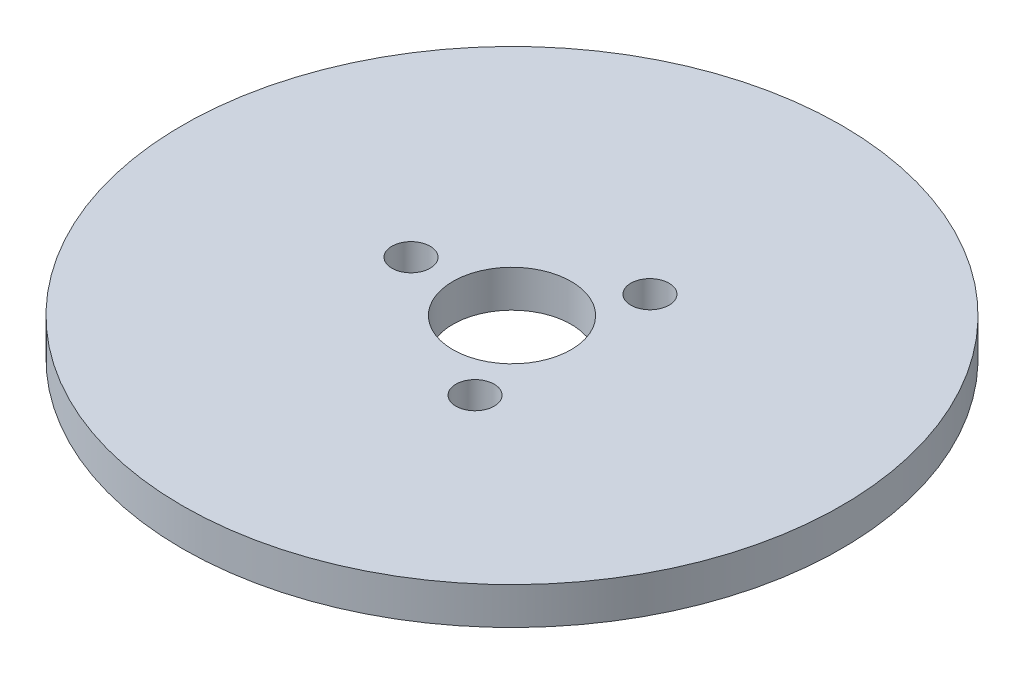
ISO-10303-21;
HEADER;
FILE_DESCRIPTION(('STEP AP214'),'2;1');
FILE_NAME('part.step','',(''),(''),'','','');
FILE_SCHEMA(('AUTOMOTIVE_DESIGN { 1 0 10303 214 1 1 1 1 }'));
ENDSEC;
DATA;
#1=APPLICATION_CONTEXT('core data for automotive mechanical design processes');
#2=APPLICATION_PROTOCOL_DEFINITION('international standard','automotive_design',2000,#1);
#3=PRODUCT_CONTEXT('',#1,'mechanical');
#4=PRODUCT('Part','Part','',(#3));
#5=PRODUCT_RELATED_PRODUCT_CATEGORY('part','',(#4));
#6=PRODUCT_DEFINITION_FORMATION('','',#4);
#7=PRODUCT_DEFINITION_CONTEXT('part definition',#1,'design');
#8=PRODUCT_DEFINITION('design','',#6,#7);
#9=PRODUCT_DEFINITION_SHAPE('','',#8);
#10=(LENGTH_UNIT() NAMED_UNIT(*) SI_UNIT(.MILLI.,.METRE.));
#11=(NAMED_UNIT(*) PLANE_ANGLE_UNIT() SI_UNIT($,.RADIAN.));
#12=(NAMED_UNIT(*) SI_UNIT($,.STERADIAN.) SOLID_ANGLE_UNIT());
#13=UNCERTAINTY_MEASURE_WITH_UNIT(LENGTH_MEASURE(1.E-05),#10,'distance_accuracy_value','');
#14=(GEOMETRIC_REPRESENTATION_CONTEXT(3) GLOBAL_UNCERTAINTY_ASSIGNED_CONTEXT((#13)) GLOBAL_UNIT_ASSIGNED_CONTEXT((#10,
#11,#12)) REPRESENTATION_CONTEXT('',''));
#15=CARTESIAN_POINT('',(0.,0.,0.));
#16=DIRECTION('',(0.,0.,1.));
#17=DIRECTION('',(1.,0.,0.));
#18=AXIS2_PLACEMENT_3D('',#15,#16,#17);
#19=CARTESIAN_POINT('',(0.,11.,0.));
#20=DIRECTION('',(0.,-1.,0.));
#21=DIRECTION('',(0.,0.,-1.));
#22=AXIS2_PLACEMENT_3D('',#19,#20,#21);
#23=CYLINDRICAL_SURFACE('',#22,97.5);
#24=CARTESIAN_POINT('',(0.,11.,0.));
#25=DIRECTION('',(0.,1.,0.));
#26=DIRECTION('',(0.,0.,1.));
#27=AXIS2_PLACEMENT_3D('',#24,#25,#26);
#28=CIRCLE('',#27,97.5);
#29=CARTESIAN_POINT('',(0.,11.,97.5));
#30=VERTEX_POINT('',#29);
#31=EDGE_CURVE('E10',#30,#30,#28,.T.);
#32=ORIENTED_EDGE('',*,*,#31,.F.);
#33=EDGE_LOOP('',(#32));
#34=FACE_BOUND('',#33,.T.);
#35=CARTESIAN_POINT('',(0.,0.,0.));
#36=DIRECTION('',(0.,1.,0.));
#37=DIRECTION('',(0.,0.,1.));
#38=AXIS2_PLACEMENT_3D('',#35,#36,#37);
#39=CIRCLE('',#38,97.5);
#40=CARTESIAN_POINT('',(0.,0.,97.5));
#41=VERTEX_POINT('',#40);
#42=EDGE_CURVE('E37',#41,#41,#39,.T.);
#43=ORIENTED_EDGE('',*,*,#42,.T.);
#44=EDGE_LOOP('',(#43));
#45=FACE_BOUND('',#44,.T.);
#46=ADVANCED_FACE('F40',(#34,#45),#23,.T.);
#47=CARTESIAN_POINT('',(0.,11.,0.));
#48=DIRECTION('',(0.,1.,0.));
#49=DIRECTION('',(0.,0.,1.));
#50=AXIS2_PLACEMENT_3D('',#47,#48,#49);
#51=PLANE('',#50);
#52=CARTESIAN_POINT('',(14.9383163242775,11.,25.8739228531838));
#53=DIRECTION('',(0.,1.,0.));
#54=DIRECTION('',(0.866025403784436,0.,-0.500000000000004));
#55=AXIS2_PLACEMENT_3D('',#52,#53,#54);
#56=CIRCLE('',#55,5.65584481475102);
#57=CARTESIAN_POINT('',(19.8364216137143,11.,23.0460004458083));
#58=VERTEX_POINT('',#57);
#59=EDGE_CURVE('E70',#58,#58,#56,.T.);
#60=ORIENTED_EDGE('',*,*,#59,.F.);
#61=EDGE_LOOP('',(#60));
#62=FACE_BOUND('',#61,.T.);
#63=CARTESIAN_POINT('',(14.9383163242771,11.,-25.873922853184));
#64=DIRECTION('',(0.,1.,0.));
#65=DIRECTION('',(-0.866025403784443,0.,-0.499999999999992));
#66=AXIS2_PLACEMENT_3D('',#63,#64,#65);
#67=CIRCLE('',#66,5.65584481475102);
#68=CARTESIAN_POINT('',(10.0402110348402,11.,-28.7018452605595));
#69=VERTEX_POINT('',#68);
#70=EDGE_CURVE('E61',#69,#69,#67,.T.);
#71=ORIENTED_EDGE('',*,*,#70,.F.);
#72=EDGE_LOOP('',(#71));
#73=FACE_BOUND('',#72,.T.);
#74=CARTESIAN_POINT('',(-29.8766326485547,11.,0.));
#75=DIRECTION('',(0.,1.,0.));
#76=DIRECTION('',(0.,0.,1.));
#77=AXIS2_PLACEMENT_3D('',#74,#75,#76);
#78=CIRCLE('',#77,5.65584481475102);
#79=CARTESIAN_POINT('',(-29.8766326485547,11.,5.65584481475102));
#80=VERTEX_POINT('',#79);
#81=EDGE_CURVE('E54',#80,#80,#78,.T.);
#82=ORIENTED_EDGE('',*,*,#81,.F.);
#83=EDGE_LOOP('',(#82));
#84=FACE_BOUND('',#83,.T.);
#85=CARTESIAN_POINT('',(0.,11.,0.));
#86=DIRECTION('',(0.,1.,0.));
#87=DIRECTION('',(0.,0.,1.));
#88=AXIS2_PLACEMENT_3D('',#85,#86,#87);
#89=CIRCLE('',#88,17.5);
#90=CARTESIAN_POINT('',(0.,11.,17.5));
#91=VERTEX_POINT('',#90);
#92=EDGE_CURVE('E50',#91,#91,#89,.T.);
#93=ORIENTED_EDGE('',*,*,#92,.F.);
#94=EDGE_LOOP('',(#93));
#95=FACE_BOUND('',#94,.T.);
#96=ORIENTED_EDGE('',*,*,#31,.T.);
#97=EDGE_LOOP('',(#96));
#98=FACE_BOUND('',#97,.T.);
#99=ADVANCED_FACE('F85',(#62,#73,#84,#95,#98),#51,.T.);
#100=CARTESIAN_POINT('',(0.,0.,0.));
#101=DIRECTION('',(0.,1.,0.));
#102=DIRECTION('',(0.,0.,1.));
#103=AXIS2_PLACEMENT_3D('',#100,#101,#102);
#104=PLANE('',#103);
#105=CARTESIAN_POINT('',(0.,0.,0.));
#106=DIRECTION('',(0.,1.,0.));
#107=DIRECTION('',(0.,0.,1.));
#108=AXIS2_PLACEMENT_3D('',#105,#106,#107);
#109=CIRCLE('',#108,17.5);
#110=CARTESIAN_POINT('',(0.,0.,17.5));
#111=VERTEX_POINT('',#110);
#112=EDGE_CURVE('E47',#111,#111,#109,.T.);
#113=ORIENTED_EDGE('',*,*,#112,.T.);
#114=EDGE_LOOP('',(#113));
#115=FACE_BOUND('',#114,.T.);
#116=ORIENTED_EDGE('',*,*,#42,.F.);
#117=EDGE_LOOP('',(#116));
#118=FACE_BOUND('',#117,.T.);
#119=ADVANCED_FACE('F84',(#115,#118),#104,.F.);
#120=CARTESIAN_POINT('',(0.,11.,0.));
#121=DIRECTION('',(0.,-1.,0.));
#122=DIRECTION('',(0.,0.,-1.));
#123=AXIS2_PLACEMENT_3D('',#120,#121,#122);
#124=CYLINDRICAL_SURFACE('',#123,17.5);
#125=ORIENTED_EDGE('',*,*,#92,.T.);
#126=EDGE_LOOP('',(#125));
#127=FACE_BOUND('',#126,.T.);
#128=ORIENTED_EDGE('',*,*,#112,.F.);
#129=EDGE_LOOP('',(#128));
#130=FACE_BOUND('',#129,.T.);
#131=ADVANCED_FACE('F91',(#127,#130),#124,.F.);
#132=CARTESIAN_POINT('',(-29.8766326485547,0.834107284151632,0.));
#133=DIRECTION('',(0.,1.,0.));
#134=DIRECTION('',(0.,0.,1.));
#135=AXIS2_PLACEMENT_3D('',#132,#133,#134);
#136=CYLINDRICAL_SURFACE('',#135,5.65584481475102);
#137=CARTESIAN_POINT('',(-29.8766326485547,0.834107284151632,0.));
#138=DIRECTION('',(0.,1.,0.));
#139=DIRECTION('',(0.,0.,1.));
#140=AXIS2_PLACEMENT_3D('',#137,#138,#139);
#141=CIRCLE('',#140,5.65584481475102);
#142=CARTESIAN_POINT('',(-29.8766326485547,0.834107284151632,5.65584481475102));
#143=VERTEX_POINT('',#142);
#144=EDGE_CURVE('E55',#143,#143,#141,.T.);
#145=ORIENTED_EDGE('',*,*,#144,.F.);
#146=EDGE_LOOP('',(#145));
#147=FACE_BOUND('',#146,.T.);
#148=ORIENTED_EDGE('',*,*,#81,.T.);
#149=EDGE_LOOP('',(#148));
#150=FACE_BOUND('',#149,.T.);
#151=ADVANCED_FACE('F96',(#147,#150),#136,.F.);
#152=CARTESIAN_POINT('',(-29.8766326485547,0.834107284151632,0.));
#153=DIRECTION('',(0.,1.,0.));
#154=DIRECTION('',(0.,0.,1.));
#155=AXIS2_PLACEMENT_3D('',#152,#153,#154);
#156=PLANE('',#155);
#157=ORIENTED_EDGE('',*,*,#144,.T.);
#158=EDGE_LOOP('',(#157));
#159=FACE_BOUND('',#158,.T.);
#160=ADVANCED_FACE('F127',(#159),#156,.T.);
#161=CARTESIAN_POINT('',(14.9383163242771,0.834107284151632,-25.873922853184));
#162=DIRECTION('',(0.,1.,0.));
#163=DIRECTION('',(0.,0.,1.));
#164=AXIS2_PLACEMENT_3D('',#161,#162,#163);
#165=CYLINDRICAL_SURFACE('',#164,5.65584481475102);
#166=CARTESIAN_POINT('',(14.9383163242771,0.834107284151632,-25.873922853184));
#167=DIRECTION('',(0.,1.,0.));
#168=DIRECTION('',(-0.866025403784443,0.,-0.499999999999992));
#169=AXIS2_PLACEMENT_3D('',#166,#167,#168);
#170=CIRCLE('',#169,5.65584481475102);
#171=CARTESIAN_POINT('',(10.0402110348402,0.834107284151632,-28.7018452605595));
#172=VERTEX_POINT('',#171);
#173=EDGE_CURVE('E63',#172,#172,#170,.T.);
#174=ORIENTED_EDGE('',*,*,#173,.F.);
#175=EDGE_LOOP('',(#174));
#176=FACE_BOUND('',#175,.T.);
#177=ORIENTED_EDGE('',*,*,#70,.T.);
#178=EDGE_LOOP('',(#177));
#179=FACE_BOUND('',#178,.T.);
#180=ADVANCED_FACE('F133',(#176,#179),#165,.F.);
#181=CARTESIAN_POINT('',(14.9383163242771,0.834107284151632,-25.873922853184));
#182=DIRECTION('',(0.,1.,0.));
#183=DIRECTION('',(-0.866025403784443,0.,-0.499999999999992));
#184=AXIS2_PLACEMENT_3D('',#181,#182,#183);
#185=PLANE('',#184);
#186=ORIENTED_EDGE('',*,*,#173,.T.);
#187=EDGE_LOOP('',(#186));
#188=FACE_BOUND('',#187,.T.);
#189=ADVANCED_FACE('F77',(#188),#185,.T.);
#190=CARTESIAN_POINT('',(14.9383163242775,0.834107284151632,25.8739228531838));
#191=DIRECTION('',(0.,1.,0.));
#192=DIRECTION('',(0.,0.,1.));
#193=AXIS2_PLACEMENT_3D('',#190,#191,#192);
#194=CYLINDRICAL_SURFACE('',#193,5.65584481475102);
#195=CARTESIAN_POINT('',(14.9383163242775,0.834107284151632,25.8739228531838));
#196=DIRECTION('',(0.,1.,0.));
#197=DIRECTION('',(0.866025403784436,0.,-0.500000000000004));
#198=AXIS2_PLACEMENT_3D('',#195,#196,#197);
#199=CIRCLE('',#198,5.65584481475102);
#200=CARTESIAN_POINT('',(19.8364216137143,0.834107284151632,23.0460004458083));
#201=VERTEX_POINT('',#200);
#202=EDGE_CURVE('E59',#201,#201,#199,.T.);
#203=ORIENTED_EDGE('',*,*,#202,.F.);
#204=EDGE_LOOP('',(#203));
#205=FACE_BOUND('',#204,.T.);
#206=ORIENTED_EDGE('',*,*,#59,.T.);
#207=EDGE_LOOP('',(#206));
#208=FACE_BOUND('',#207,.T.);
#209=ADVANCED_FACE('F73',(#205,#208),#194,.F.);
#210=CARTESIAN_POINT('',(14.9383163242775,0.834107284151632,25.8739228531838));
#211=DIRECTION('',(0.,1.,0.));
#212=DIRECTION('',(0.866025403784436,0.,-0.500000000000004));
#213=AXIS2_PLACEMENT_3D('',#210,#211,#212);
#214=PLANE('',#213);
#215=ORIENTED_EDGE('',*,*,#202,.T.);
#216=EDGE_LOOP('',(#215));
#217=FACE_BOUND('',#216,.T.);
#218=ADVANCED_FACE('F71',(#217),#214,.T.);
#219=CLOSED_SHELL('',(#46,#99,#119,#131,#151,#160,#180,#189,#209,#218));
#220=MANIFOLD_SOLID_BREP('B2',#219);
#221=ADVANCED_BREP_SHAPE_REPRESENTATION('',(#18,#220),#14);
#222=SHAPE_DEFINITION_REPRESENTATION(#9,#221);
ENDSEC;
END-ISO-10303-21;
